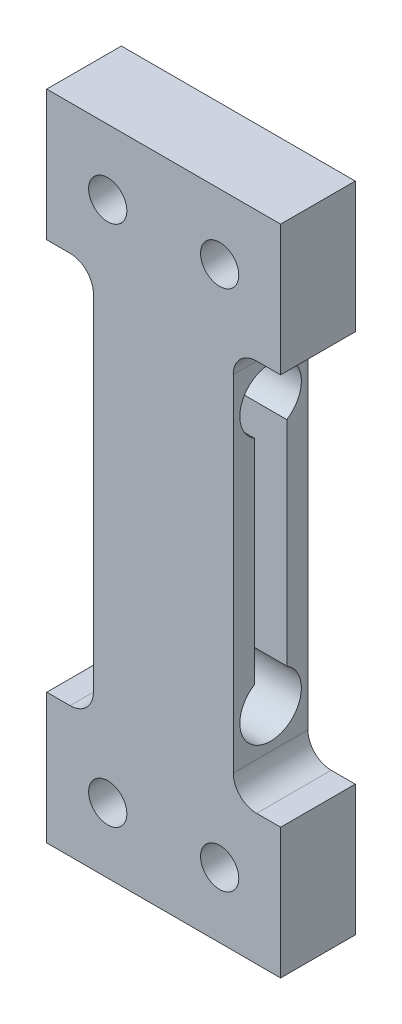
ISO-10303-21;
HEADER;
FILE_DESCRIPTION(('STEP AP214'),'2;1');
FILE_NAME('part.step','',(''),(''),'','','');
FILE_SCHEMA(('AUTOMOTIVE_DESIGN { 1 0 10303 214 1 1 1 1 }'));
ENDSEC;
DATA;
#1=APPLICATION_CONTEXT('core data for automotive mechanical design processes');
#2=APPLICATION_PROTOCOL_DEFINITION('international standard','automotive_design',2000,#1);
#3=PRODUCT_CONTEXT('',#1,'mechanical');
#4=PRODUCT('Part','Part','',(#3));
#5=PRODUCT_RELATED_PRODUCT_CATEGORY('part','',(#4));
#6=PRODUCT_DEFINITION_FORMATION('','',#4);
#7=PRODUCT_DEFINITION_CONTEXT('part definition',#1,'design');
#8=PRODUCT_DEFINITION('design','',#6,#7);
#9=PRODUCT_DEFINITION_SHAPE('','',#8);
#10=(LENGTH_UNIT() NAMED_UNIT(*) SI_UNIT(.MILLI.,.METRE.));
#11=(NAMED_UNIT(*) PLANE_ANGLE_UNIT() SI_UNIT($,.RADIAN.));
#12=(NAMED_UNIT(*) SI_UNIT($,.STERADIAN.) SOLID_ANGLE_UNIT());
#13=UNCERTAINTY_MEASURE_WITH_UNIT(LENGTH_MEASURE(1.E-05),#10,'distance_accuracy_value','');
#14=(GEOMETRIC_REPRESENTATION_CONTEXT(3) GLOBAL_UNCERTAINTY_ASSIGNED_CONTEXT((#13)) GLOBAL_UNIT_ASSIGNED_CONTEXT((#10,
#11,#12)) REPRESENTATION_CONTEXT('',''));
#15=CARTESIAN_POINT('',(0.,0.,0.));
#16=DIRECTION('',(0.,0.,1.));
#17=DIRECTION('',(1.,0.,0.));
#18=AXIS2_PLACEMENT_3D('',#15,#16,#17);
#19=CARTESIAN_POINT('',(2.53843426704407,0.,0.));
#20=DIRECTION('',(1.,0.,0.));
#21=DIRECTION('',(0.,0.,-1.));
#22=AXIS2_PLACEMENT_3D('',#19,#20,#21);
#23=PLANE('',#22);
#24=DIRECTION('',(0.,0.,-1.));
#25=VECTOR('',#24,1.);
#26=CARTESIAN_POINT('',(2.53843426704407,28.,4.));
#27=LINE('',#26,#25);
#28=CARTESIAN_POINT('',(2.53843426704407,28.,4.));
#29=VERTEX_POINT('',#28);
#30=CARTESIAN_POINT('',(2.53843426704407,28.,0.));
#31=VERTEX_POINT('',#30);
#32=EDGE_CURVE('E220',#29,#31,#27,.T.);
#33=ORIENTED_EDGE('',*,*,#32,.T.);
#34=DIRECTION('',(0.,1.,0.));
#35=VECTOR('',#34,1.);
#36=CARTESIAN_POINT('',(2.53843426704407,0.,0.));
#37=LINE('',#36,#35);
#38=CARTESIAN_POINT('',(2.53843426704407,35.,0.));
#39=VERTEX_POINT('',#38);
#40=EDGE_CURVE('E257',#31,#39,#37,.T.);
#41=ORIENTED_EDGE('',*,*,#40,.T.);
#42=DIRECTION('',(0.,0.,1.));
#43=VECTOR('',#42,1.);
#44=CARTESIAN_POINT('',(2.53843426704407,35.,0.));
#45=LINE('',#44,#43);
#46=CARTESIAN_POINT('',(2.53843426704407,35.,4.));
#47=VERTEX_POINT('',#46);
#48=EDGE_CURVE('E274',#39,#47,#45,.T.);
#49=ORIENTED_EDGE('',*,*,#48,.T.);
#50=DIRECTION('',(0.,1.,0.));
#51=VECTOR('',#50,1.);
#52=CARTESIAN_POINT('',(2.53843426704407,0.,4.));
#53=LINE('',#52,#51);
#54=EDGE_CURVE('E271',#29,#47,#53,.T.);
#55=ORIENTED_EDGE('',*,*,#54,.F.);
#56=EDGE_LOOP('',(#33,#41,#49,#55));
#57=FACE_BOUND('',#56,.T.);
#58=ADVANCED_FACE('F34',(#57),#23,.T.);
#59=CARTESIAN_POINT('',(-10.,35.,0.));
#60=DIRECTION('',(-1.,0.,0.));
#61=DIRECTION('',(0.,0.,1.));
#62=AXIS2_PLACEMENT_3D('',#59,#60,#61);
#63=PLANE('',#62);
#64=DIRECTION('',(0.,0.,-1.));
#65=VECTOR('',#64,1.);
#66=CARTESIAN_POINT('',(-10.,7.,4.));
#67=LINE('',#66,#65);
#68=CARTESIAN_POINT('',(-10.,7.,4.));
#69=VERTEX_POINT('',#68);
#70=CARTESIAN_POINT('',(-10.,7.,0.));
#71=VERTEX_POINT('',#70);
#72=EDGE_CURVE('E241',#69,#71,#67,.T.);
#73=ORIENTED_EDGE('',*,*,#72,.T.);
#74=DIRECTION('',(0.,-1.,0.));
#75=VECTOR('',#74,1.);
#76=CARTESIAN_POINT('',(-10.,35.,0.));
#77=LINE('',#76,#75);
#78=CARTESIAN_POINT('',(-10.,0.,0.));
#79=VERTEX_POINT('',#78);
#80=EDGE_CURVE('E249',#71,#79,#77,.T.);
#81=ORIENTED_EDGE('',*,*,#80,.T.);
#82=DIRECTION('',(0.,0.,1.));
#83=VECTOR('',#82,1.);
#84=CARTESIAN_POINT('',(-10.,0.,0.));
#85=LINE('',#84,#83);
#86=CARTESIAN_POINT('',(-10.,0.,4.));
#87=VERTEX_POINT('',#86);
#88=EDGE_CURVE('E280',#79,#87,#85,.T.);
#89=ORIENTED_EDGE('',*,*,#88,.T.);
#90=DIRECTION('',(0.,-1.,0.));
#91=VECTOR('',#90,1.);
#92=CARTESIAN_POINT('',(-10.,35.,4.));
#93=LINE('',#92,#91);
#94=EDGE_CURVE('E264',#69,#87,#93,.T.);
#95=ORIENTED_EDGE('',*,*,#94,.F.);
#96=EDGE_LOOP('',(#73,#81,#89,#95));
#97=FACE_BOUND('',#96,.T.);
#98=ADVANCED_FACE('F354',(#97),#63,.T.);
#99=CARTESIAN_POINT('',(2.53843426704407,35.,0.));
#100=DIRECTION('',(0.,1.,0.));
#101=DIRECTION('',(0.,0.,1.));
#102=AXIS2_PLACEMENT_3D('',#99,#100,#101);
#103=PLANE('',#102);
#104=DIRECTION('',(-1.,0.,0.));
#105=VECTOR('',#104,1.);
#106=CARTESIAN_POINT('',(2.53843426704407,35.,4.));
#107=LINE('',#106,#105);
#108=CARTESIAN_POINT('',(-10.,35.,4.));
#109=VERTEX_POINT('',#108);
#110=EDGE_CURVE('E244',#47,#109,#107,.T.);
#111=ORIENTED_EDGE('',*,*,#110,.F.);
#112=ORIENTED_EDGE('',*,*,#48,.F.);
#113=DIRECTION('',(-1.,0.,0.));
#114=VECTOR('',#113,1.);
#115=CARTESIAN_POINT('',(2.53843426704407,35.,0.));
#116=LINE('',#115,#114);
#117=CARTESIAN_POINT('',(-10.,35.,0.));
#118=VERTEX_POINT('',#117);
#119=EDGE_CURVE('E246',#39,#118,#116,.T.);
#120=ORIENTED_EDGE('',*,*,#119,.T.);
#121=DIRECTION('',(0.,0.,1.));
#122=VECTOR('',#121,1.);
#123=CARTESIAN_POINT('',(-10.,35.,0.));
#124=LINE('',#123,#122);
#125=EDGE_CURVE('E261',#118,#109,#124,.T.);
#126=ORIENTED_EDGE('',*,*,#125,.T.);
#127=EDGE_LOOP('',(#111,#112,#120,#126));
#128=FACE_BOUND('',#127,.T.);
#129=ADVANCED_FACE('F382',(#128),#103,.T.);
#130=DIRECTION('',(0.,0.,-1.));
#131=VECTOR('',#130,1.);
#132=CARTESIAN_POINT('',(2.53843426704407,7.,4.));
#133=LINE('',#132,#131);
#134=CARTESIAN_POINT('',(2.53843426704407,7.,4.));
#135=VERTEX_POINT('',#134);
#136=CARTESIAN_POINT('',(2.53843426704407,7.,0.));
#137=VERTEX_POINT('',#136);
#138=EDGE_CURVE('E214',#135,#137,#133,.T.);
#139=ORIENTED_EDGE('',*,*,#138,.F.);
#140=CARTESIAN_POINT('',(2.53843426704407,0.,4.));
#141=VERTEX_POINT('',#140);
#142=EDGE_CURVE('E250',#141,#135,#53,.T.);
#143=ORIENTED_EDGE('',*,*,#142,.F.);
#144=DIRECTION('',(0.,0.,1.));
#145=VECTOR('',#144,1.);
#146=CARTESIAN_POINT('',(2.53843426704407,0.,0.));
#147=LINE('',#146,#145);
#148=CARTESIAN_POINT('',(2.53843426704407,0.,0.));
#149=VERTEX_POINT('',#148);
#150=EDGE_CURVE('E278',#149,#141,#147,.T.);
#151=ORIENTED_EDGE('',*,*,#150,.F.);
#152=EDGE_CURVE('E258',#149,#137,#37,.T.);
#153=ORIENTED_EDGE('',*,*,#152,.T.);
#154=EDGE_LOOP('',(#139,#143,#151,#153));
#155=FACE_BOUND('',#154,.T.);
#156=ADVANCED_FACE('F343',(#155),#23,.T.);
#157=CARTESIAN_POINT('',(-10.,0.,0.));
#158=DIRECTION('',(0.,-1.,0.));
#159=DIRECTION('',(0.,0.,-1.));
#160=AXIS2_PLACEMENT_3D('',#157,#158,#159);
#161=PLANE('',#160);
#162=DIRECTION('',(1.,0.,0.));
#163=VECTOR('',#162,1.);
#164=CARTESIAN_POINT('',(-10.,0.,4.));
#165=LINE('',#164,#163);
#166=EDGE_CURVE('E268',#87,#141,#165,.T.);
#167=ORIENTED_EDGE('',*,*,#166,.F.);
#168=ORIENTED_EDGE('',*,*,#88,.F.);
#169=DIRECTION('',(1.,0.,0.));
#170=VECTOR('',#169,1.);
#171=CARTESIAN_POINT('',(-10.,0.,0.));
#172=LINE('',#171,#170);
#173=EDGE_CURVE('E254',#79,#149,#172,.T.);
#174=ORIENTED_EDGE('',*,*,#173,.T.);
#175=ORIENTED_EDGE('',*,*,#150,.T.);
#176=EDGE_LOOP('',(#167,#168,#174,#175));
#177=FACE_BOUND('',#176,.T.);
#178=ADVANCED_FACE('F351',(#177),#161,.T.);
#179=DIRECTION('',(0.,0.,-1.));
#180=VECTOR('',#179,1.);
#181=CARTESIAN_POINT('',(-10.,28.,4.));
#182=LINE('',#181,#180);
#183=CARTESIAN_POINT('',(-10.,28.,4.));
#184=VERTEX_POINT('',#183);
#185=CARTESIAN_POINT('',(-10.,28.,0.));
#186=VERTEX_POINT('',#185);
#187=EDGE_CURVE('E234',#184,#186,#182,.T.);
#188=ORIENTED_EDGE('',*,*,#187,.F.);
#189=EDGE_CURVE('E265',#109,#184,#93,.T.);
#190=ORIENTED_EDGE('',*,*,#189,.F.);
#191=ORIENTED_EDGE('',*,*,#125,.F.);
#192=EDGE_CURVE('E251',#118,#186,#77,.T.);
#193=ORIENTED_EDGE('',*,*,#192,.T.);
#194=EDGE_LOOP('',(#188,#190,#191,#193));
#195=FACE_BOUND('',#194,.T.);
#196=ADVANCED_FACE('F378',(#195),#63,.T.);
#197=CARTESIAN_POINT('',(-10.,35.,0.));
#198=DIRECTION('',(0.,0.,1.));
#199=DIRECTION('',(1.,0.,0.));
#200=AXIS2_PLACEMENT_3D('',#197,#198,#199);
#201=PLANE('',#200);
#202=CARTESIAN_POINT('',(-0.730782866478019,3.49999999999998,0.));
#203=DIRECTION('',(0.,0.,1.));
#204=DIRECTION('',(1.,0.,0.));
#205=AXIS2_PLACEMENT_3D('',#202,#203,#204);
#206=CIRCLE('',#205,1.025);
#207=CARTESIAN_POINT('',(0.29421713352198,3.49999999999998,0.));
#208=VERTEX_POINT('',#207);
#209=EDGE_CURVE('E628',#208,#208,#206,.T.);
#210=ORIENTED_EDGE('',*,*,#209,.T.);
#211=EDGE_LOOP('',(#210));
#212=FACE_BOUND('',#211,.T.);
#213=CARTESIAN_POINT('',(-6.73078286647802,3.5,0.));
#214=DIRECTION('',(0.,0.,1.));
#215=DIRECTION('',(1.,0.,0.));
#216=AXIS2_PLACEMENT_3D('',#213,#214,#215);
#217=CIRCLE('',#216,1.025);
#218=CARTESIAN_POINT('',(-5.70578286647802,3.5,0.));
#219=VERTEX_POINT('',#218);
#220=EDGE_CURVE('E622',#219,#219,#217,.T.);
#221=ORIENTED_EDGE('',*,*,#220,.T.);
#222=EDGE_LOOP('',(#221));
#223=FACE_BOUND('',#222,.T.);
#224=CARTESIAN_POINT('',(-0.730782866478016,31.5,0.));
#225=DIRECTION('',(0.,0.,1.));
#226=DIRECTION('',(1.,0.,0.));
#227=AXIS2_PLACEMENT_3D('',#224,#225,#226);
#228=CIRCLE('',#227,1.025);
#229=CARTESIAN_POINT('',(0.294217133521983,31.5,0.));
#230=VERTEX_POINT('',#229);
#231=EDGE_CURVE('E616',#230,#230,#228,.T.);
#232=ORIENTED_EDGE('',*,*,#231,.T.);
#233=EDGE_LOOP('',(#232));
#234=FACE_BOUND('',#233,.T.);
#235=CARTESIAN_POINT('',(-6.73078286647802,31.5,0.));
#236=DIRECTION('',(0.,0.,1.));
#237=DIRECTION('',(1.,0.,0.));
#238=AXIS2_PLACEMENT_3D('',#235,#236,#237);
#239=CIRCLE('',#238,1.025);
#240=CARTESIAN_POINT('',(-5.70578286647802,31.5,0.));
#241=VERTEX_POINT('',#240);
#242=EDGE_CURVE('E192',#241,#241,#239,.T.);
#243=ORIENTED_EDGE('',*,*,#242,.T.);
#244=EDGE_LOOP('',(#243));
#245=FACE_BOUND('',#244,.T.);
#246=ORIENTED_EDGE('',*,*,#40,.F.);
#247=DIRECTION('',(1.,0.,0.));
#248=VECTOR('',#247,1.);
#249=CARTESIAN_POINT('',(0.,28.,0.));
#250=LINE('',#249,#248);
#251=CARTESIAN_POINT('',(1.25,28.,0.));
#252=VERTEX_POINT('',#251);
#253=EDGE_CURVE('E209',#252,#31,#250,.T.);
#254=ORIENTED_EDGE('',*,*,#253,.F.);
#255=CARTESIAN_POINT('',(1.25,26.75,0.));
#256=DIRECTION('',(0.,0.,1.));
#257=DIRECTION('',(1.,0.,0.));
#258=AXIS2_PLACEMENT_3D('',#255,#256,#257);
#259=CIRCLE('',#258,1.25);
#260=CARTESIAN_POINT('',(0.,26.75,0.));
#261=VERTEX_POINT('',#260);
#262=EDGE_CURVE('E315',#252,#261,#259,.T.);
#263=ORIENTED_EDGE('',*,*,#262,.T.);
#264=DIRECTION('',(0.,1.,0.));
#265=VECTOR('',#264,1.);
#266=CARTESIAN_POINT('',(0.,6.99999999999999,0.));
#267=LINE('',#266,#265);
#268=CARTESIAN_POINT('',(0.,8.24999999999999,0.));
#269=VERTEX_POINT('',#268);
#270=EDGE_CURVE('E216',#269,#261,#267,.T.);
#271=ORIENTED_EDGE('',*,*,#270,.F.);
#272=CARTESIAN_POINT('',(1.25,8.24999999999999,0.));
#273=DIRECTION('',(0.,0.,1.));
#274=DIRECTION('',(1.,0.,0.));
#275=AXIS2_PLACEMENT_3D('',#272,#273,#274);
#276=CIRCLE('',#275,1.25);
#277=CARTESIAN_POINT('',(1.25,7.,0.));
#278=VERTEX_POINT('',#277);
#279=EDGE_CURVE('E42',#269,#278,#276,.T.);
#280=ORIENTED_EDGE('',*,*,#279,.T.);
#281=DIRECTION('',(-1.,0.,0.));
#282=VECTOR('',#281,1.);
#283=CARTESIAN_POINT('',(2.53843426704407,7.,0.));
#284=LINE('',#283,#282);
#285=EDGE_CURVE('E180',#137,#278,#284,.T.);
#286=ORIENTED_EDGE('',*,*,#285,.F.);
#287=ORIENTED_EDGE('',*,*,#152,.F.);
#288=ORIENTED_EDGE('',*,*,#173,.F.);
#289=ORIENTED_EDGE('',*,*,#80,.F.);
#290=DIRECTION('',(-1.,0.,0.));
#291=VECTOR('',#290,1.);
#292=CARTESIAN_POINT('',(-7.5,6.99999999999999,0.));
#293=LINE('',#292,#291);
#294=CARTESIAN_POINT('',(-8.75000000000001,6.99999999999999,0.));
#295=VERTEX_POINT('',#294);
#296=EDGE_CURVE('E229',#295,#71,#293,.T.);
#297=ORIENTED_EDGE('',*,*,#296,.F.);
#298=CARTESIAN_POINT('',(-8.75,8.24999999999999,0.));
#299=DIRECTION('',(0.,0.,1.));
#300=DIRECTION('',(1.,0.,0.));
#301=AXIS2_PLACEMENT_3D('',#298,#299,#300);
#302=CIRCLE('',#301,1.25);
#303=CARTESIAN_POINT('',(-7.5,8.24999999999999,0.));
#304=VERTEX_POINT('',#303);
#305=EDGE_CURVE('E311',#295,#304,#302,.T.);
#306=ORIENTED_EDGE('',*,*,#305,.T.);
#307=DIRECTION('',(0.,-1.,0.));
#308=VECTOR('',#307,1.);
#309=CARTESIAN_POINT('',(-7.5,28.,0.));
#310=LINE('',#309,#308);
#311=CARTESIAN_POINT('',(-7.5,26.75,0.));
#312=VERTEX_POINT('',#311);
#313=EDGE_CURVE('E237',#312,#304,#310,.T.);
#314=ORIENTED_EDGE('',*,*,#313,.F.);
#315=CARTESIAN_POINT('',(-8.75,26.75,0.));
#316=DIRECTION('',(0.,0.,1.));
#317=DIRECTION('',(1.,0.,0.));
#318=AXIS2_PLACEMENT_3D('',#315,#316,#317);
#319=CIRCLE('',#318,1.25);
#320=CARTESIAN_POINT('',(-8.74999999999999,28.,0.));
#321=VERTEX_POINT('',#320);
#322=EDGE_CURVE('E307',#312,#321,#319,.T.);
#323=ORIENTED_EDGE('',*,*,#322,.T.);
#324=DIRECTION('',(1.,0.,0.));
#325=VECTOR('',#324,1.);
#326=CARTESIAN_POINT('',(-10.,28.,0.));
#327=LINE('',#326,#325);
#328=EDGE_CURVE('E223',#186,#321,#327,.T.);
#329=ORIENTED_EDGE('',*,*,#328,.F.);
#330=ORIENTED_EDGE('',*,*,#192,.F.);
#331=ORIENTED_EDGE('',*,*,#119,.F.);
#332=EDGE_LOOP('',(#246,#254,#263,#271,#280,#286,#287,#288,#289,#297,#306,#314,#323,#329,#330,#331));
#333=FACE_BOUND('',#332,.T.);
#334=ADVANCED_FACE('F333',(#212,#223,#234,#245,#333),#201,.F.);
#335=CARTESIAN_POINT('',(-10.,35.,4.));
#336=DIRECTION('',(0.,0.,1.));
#337=DIRECTION('',(1.,0.,0.));
#338=AXIS2_PLACEMENT_3D('',#335,#336,#337);
#339=PLANE('',#338);
#340=CARTESIAN_POINT('',(-0.730782866478019,3.49999999999998,4.));
#341=DIRECTION('',(0.,0.,1.));
#342=DIRECTION('',(1.,0.,0.));
#343=AXIS2_PLACEMENT_3D('',#340,#341,#342);
#344=CIRCLE('',#343,1.02499999999999);
#345=CARTESIAN_POINT('',(0.294217133521969,3.49999999999998,4.));
#346=VERTEX_POINT('',#345);
#347=EDGE_CURVE('E631',#346,#346,#344,.T.);
#348=ORIENTED_EDGE('',*,*,#347,.F.);
#349=EDGE_LOOP('',(#348));
#350=FACE_BOUND('',#349,.T.);
#351=CARTESIAN_POINT('',(-6.73078286647802,3.5,4.));
#352=DIRECTION('',(0.,0.,1.));
#353=DIRECTION('',(1.,0.,0.));
#354=AXIS2_PLACEMENT_3D('',#351,#352,#353);
#355=CIRCLE('',#354,1.02499999999999);
#356=CARTESIAN_POINT('',(-5.70578286647803,3.5,4.));
#357=VERTEX_POINT('',#356);
#358=EDGE_CURVE('E625',#357,#357,#355,.T.);
#359=ORIENTED_EDGE('',*,*,#358,.F.);
#360=EDGE_LOOP('',(#359));
#361=FACE_BOUND('',#360,.T.);
#362=CARTESIAN_POINT('',(-0.730782866478016,31.5,4.));
#363=DIRECTION('',(0.,0.,1.));
#364=DIRECTION('',(1.,0.,0.));
#365=AXIS2_PLACEMENT_3D('',#362,#363,#364);
#366=CIRCLE('',#365,1.02499999999999);
#367=CARTESIAN_POINT('',(0.294217133521972,31.5,4.));
#368=VERTEX_POINT('',#367);
#369=EDGE_CURVE('E619',#368,#368,#366,.T.);
#370=ORIENTED_EDGE('',*,*,#369,.F.);
#371=EDGE_LOOP('',(#370));
#372=FACE_BOUND('',#371,.T.);
#373=CARTESIAN_POINT('',(-6.73078286647802,31.5,4.));
#374=DIRECTION('',(0.,0.,1.));
#375=DIRECTION('',(1.,0.,0.));
#376=AXIS2_PLACEMENT_3D('',#373,#374,#375);
#377=CIRCLE('',#376,1.02499999999999);
#378=CARTESIAN_POINT('',(-5.70578286647803,31.5,4.));
#379=VERTEX_POINT('',#378);
#380=EDGE_CURVE('E613',#379,#379,#377,.T.);
#381=ORIENTED_EDGE('',*,*,#380,.F.);
#382=EDGE_LOOP('',(#381));
#383=FACE_BOUND('',#382,.T.);
#384=DIRECTION('',(0.,1.,0.));
#385=VECTOR('',#384,1.);
#386=CARTESIAN_POINT('',(0.,6.99999999999999,4.));
#387=LINE('',#386,#385);
#388=CARTESIAN_POINT('',(0.,8.24999999999999,4.));
#389=VERTEX_POINT('',#388);
#390=CARTESIAN_POINT('',(0.,26.75,4.));
#391=VERTEX_POINT('',#390);
#392=EDGE_CURVE('E208',#389,#391,#387,.T.);
#393=ORIENTED_EDGE('',*,*,#392,.T.);
#394=CARTESIAN_POINT('',(1.25,26.75,4.));
#395=DIRECTION('',(0.,0.,1.));
#396=DIRECTION('',(1.,0.,0.));
#397=AXIS2_PLACEMENT_3D('',#394,#395,#396);
#398=CIRCLE('',#397,1.25);
#399=CARTESIAN_POINT('',(1.25,28.,4.));
#400=VERTEX_POINT('',#399);
#401=EDGE_CURVE('E317',#391,#400,#398,.F.);
#402=ORIENTED_EDGE('',*,*,#401,.T.);
#403=DIRECTION('',(1.,0.,0.));
#404=VECTOR('',#403,1.);
#405=CARTESIAN_POINT('',(0.,28.,4.));
#406=LINE('',#405,#404);
#407=EDGE_CURVE('E212',#400,#29,#406,.T.);
#408=ORIENTED_EDGE('',*,*,#407,.T.);
#409=ORIENTED_EDGE('',*,*,#54,.T.);
#410=ORIENTED_EDGE('',*,*,#110,.T.);
#411=ORIENTED_EDGE('',*,*,#189,.T.);
#412=DIRECTION('',(1.,0.,0.));
#413=VECTOR('',#412,1.);
#414=CARTESIAN_POINT('',(-10.,28.,4.));
#415=LINE('',#414,#413);
#416=CARTESIAN_POINT('',(-8.74999999999999,28.,4.));
#417=VERTEX_POINT('',#416);
#418=EDGE_CURVE('E225',#184,#417,#415,.T.);
#419=ORIENTED_EDGE('',*,*,#418,.T.);
#420=CARTESIAN_POINT('',(-8.75,26.75,4.));
#421=DIRECTION('',(0.,0.,1.));
#422=DIRECTION('',(1.,0.,0.));
#423=AXIS2_PLACEMENT_3D('',#420,#421,#422);
#424=CIRCLE('',#423,1.25);
#425=CARTESIAN_POINT('',(-7.5,26.75,4.));
#426=VERTEX_POINT('',#425);
#427=EDGE_CURVE('E309',#417,#426,#424,.F.);
#428=ORIENTED_EDGE('',*,*,#427,.T.);
#429=DIRECTION('',(0.,-1.,0.));
#430=VECTOR('',#429,1.);
#431=CARTESIAN_POINT('',(-7.5,28.,4.));
#432=LINE('',#431,#430);
#433=CARTESIAN_POINT('',(-7.5,8.24999999999999,4.));
#434=VERTEX_POINT('',#433);
#435=EDGE_CURVE('E228',#426,#434,#432,.T.);
#436=ORIENTED_EDGE('',*,*,#435,.T.);
#437=CARTESIAN_POINT('',(-8.75,8.24999999999999,4.));
#438=DIRECTION('',(0.,0.,1.));
#439=DIRECTION('',(1.,0.,0.));
#440=AXIS2_PLACEMENT_3D('',#437,#438,#439);
#441=CIRCLE('',#440,1.25);
#442=CARTESIAN_POINT('',(-8.75000000000001,6.99999999999999,4.));
#443=VERTEX_POINT('',#442);
#444=EDGE_CURVE('E313',#434,#443,#441,.F.);
#445=ORIENTED_EDGE('',*,*,#444,.T.);
#446=DIRECTION('',(-1.,0.,0.));
#447=VECTOR('',#446,1.);
#448=CARTESIAN_POINT('',(-7.5,6.99999999999999,4.));
#449=LINE('',#448,#447);
#450=EDGE_CURVE('E232',#443,#69,#449,.T.);
#451=ORIENTED_EDGE('',*,*,#450,.T.);
#452=ORIENTED_EDGE('',*,*,#94,.T.);
#453=ORIENTED_EDGE('',*,*,#166,.T.);
#454=ORIENTED_EDGE('',*,*,#142,.T.);
#455=DIRECTION('',(-1.,0.,0.));
#456=VECTOR('',#455,1.);
#457=CARTESIAN_POINT('',(2.53843426704407,7.,4.));
#458=LINE('',#457,#456);
#459=CARTESIAN_POINT('',(1.25,7.,4.));
#460=VERTEX_POINT('',#459);
#461=EDGE_CURVE('E206',#135,#460,#458,.T.);
#462=ORIENTED_EDGE('',*,*,#461,.T.);
#463=CARTESIAN_POINT('',(1.25,8.24999999999999,4.));
#464=DIRECTION('',(0.,0.,1.));
#465=DIRECTION('',(1.,0.,0.));
#466=AXIS2_PLACEMENT_3D('',#463,#464,#465);
#467=CIRCLE('',#466,1.25);
#468=EDGE_CURVE('E11',#460,#389,#467,.F.);
#469=ORIENTED_EDGE('',*,*,#468,.T.);
#470=EDGE_LOOP('',(#393,#402,#408,#409,#410,#411,#419,#428,#436,#445,#451,#452,#453,#454,#462,#469));
#471=FACE_BOUND('',#470,.T.);
#472=ADVANCED_FACE('F321',(#350,#361,#372,#383,#471),#339,.T.);
#473=CARTESIAN_POINT('',(-7.5,6.99999999999999,4.));
#474=DIRECTION('',(0.,-1.,0.));
#475=DIRECTION('',(1.,0.,0.));
#476=AXIS2_PLACEMENT_3D('',#473,#474,#475);
#477=PLANE('',#476);
#478=ORIENTED_EDGE('',*,*,#450,.F.);
#479=DIRECTION('',(0.,0.,-1.));
#480=VECTOR('',#479,1.);
#481=CARTESIAN_POINT('',(-8.75000000000001,6.99999999999999,0.));
#482=LINE('',#481,#480);
#483=EDGE_CURVE('E295',#443,#295,#482,.T.);
#484=ORIENTED_EDGE('',*,*,#483,.T.);
#485=ORIENTED_EDGE('',*,*,#296,.T.);
#486=ORIENTED_EDGE('',*,*,#72,.F.);
#487=EDGE_LOOP('',(#478,#484,#485,#486));
#488=FACE_BOUND('',#487,.T.);
#489=ADVANCED_FACE('F358',(#488),#477,.F.);
#490=CARTESIAN_POINT('',(-7.5,28.,4.));
#491=DIRECTION('',(1.,0.,0.));
#492=DIRECTION('',(0.,1.,0.));
#493=AXIS2_PLACEMENT_3D('',#490,#491,#492);
#494=PLANE('',#493);
#495=DIRECTION('',(0.,1.,0.));
#496=VECTOR('',#495,1.);
#497=CARTESIAN_POINT('',(-7.5,11.7856301404825,2.85593376306963));
#498=LINE('',#497,#496);
#499=CARTESIAN_POINT('',(-7.5,11.7856301404825,2.85593376306963));
#500=VERTEX_POINT('',#499);
#501=CARTESIAN_POINT('',(-7.5,23.2143698595176,2.85593376306961));
#502=VERTEX_POINT('',#501);
#503=EDGE_CURVE('E191',#500,#502,#498,.T.);
#504=ORIENTED_EDGE('',*,*,#503,.F.);
#505=CARTESIAN_POINT('',(-7.5,10.375,2.));
#506=DIRECTION('',(-1.,0.,0.));
#507=DIRECTION('',(0.,0.,1.));
#508=AXIS2_PLACEMENT_3D('',#505,#506,#507);
#509=CIRCLE('',#508,1.65000000000002);
#510=CARTESIAN_POINT('',(-7.5,11.7781326807042,1.13183026985506));
#511=VERTEX_POINT('',#510);
#512=EDGE_CURVE('E172',#511,#500,#509,.T.);
#513=ORIENTED_EDGE('',*,*,#512,.F.);
#514=DIRECTION('',(0.,-1.,0.));
#515=VECTOR('',#514,1.);
#516=CARTESIAN_POINT('',(-7.5,23.2218673192958,1.13183026985509));
#517=LINE('',#516,#515);
#518=CARTESIAN_POINT('',(-7.5,23.2218673192958,1.13183026985507));
#519=VERTEX_POINT('',#518);
#520=EDGE_CURVE('E189',#519,#511,#517,.T.);
#521=ORIENTED_EDGE('',*,*,#520,.F.);
#522=CARTESIAN_POINT('',(-7.5,24.625,2.));
#523=DIRECTION('',(-1.,0.,0.));
#524=DIRECTION('',(0.,0.,1.));
#525=AXIS2_PLACEMENT_3D('',#522,#523,#524);
#526=CIRCLE('',#525,1.65000000000001);
#527=EDGE_CURVE('E606',#502,#519,#526,.T.);
#528=ORIENTED_EDGE('',*,*,#527,.F.);
#529=EDGE_LOOP('',(#504,#513,#521,#528));
#530=FACE_BOUND('',#529,.T.);
#531=ORIENTED_EDGE('',*,*,#435,.F.);
#532=DIRECTION('',(0.,0.,-1.));
#533=VECTOR('',#532,1.);
#534=CARTESIAN_POINT('',(-7.5,26.75,0.));
#535=LINE('',#534,#533);
#536=EDGE_CURVE('E290',#426,#312,#535,.T.);
#537=ORIENTED_EDGE('',*,*,#536,.T.);
#538=ORIENTED_EDGE('',*,*,#313,.T.);
#539=DIRECTION('',(0.,0.,-1.));
#540=VECTOR('',#539,1.);
#541=CARTESIAN_POINT('',(-7.5,8.24999999999999,4.));
#542=LINE('',#541,#540);
#543=EDGE_CURVE('E288',#304,#434,#542,.F.);
#544=ORIENTED_EDGE('',*,*,#543,.T.);
#545=EDGE_LOOP('',(#531,#537,#538,#544));
#546=FACE_BOUND('',#545,.T.);
#547=ADVANCED_FACE('F186',(#530,#546),#494,.F.);
#548=CARTESIAN_POINT('',(-10.,28.,4.));
#549=DIRECTION('',(0.,1.,0.));
#550=DIRECTION('',(-1.,0.,0.));
#551=AXIS2_PLACEMENT_3D('',#548,#549,#550);
#552=PLANE('',#551);
#553=ORIENTED_EDGE('',*,*,#328,.T.);
#554=DIRECTION('',(0.,0.,-1.));
#555=VECTOR('',#554,1.);
#556=CARTESIAN_POINT('',(-8.74999999999999,28.,4.));
#557=LINE('',#556,#555);
#558=EDGE_CURVE('E293',#321,#417,#557,.F.);
#559=ORIENTED_EDGE('',*,*,#558,.T.);
#560=ORIENTED_EDGE('',*,*,#418,.F.);
#561=ORIENTED_EDGE('',*,*,#187,.T.);
#562=EDGE_LOOP('',(#553,#559,#560,#561));
#563=FACE_BOUND('',#562,.T.);
#564=ADVANCED_FACE('F374',(#563),#552,.F.);
#565=CARTESIAN_POINT('',(0.,28.,4.));
#566=DIRECTION('',(0.,1.,0.));
#567=DIRECTION('',(-1.,0.,0.));
#568=AXIS2_PLACEMENT_3D('',#565,#566,#567);
#569=PLANE('',#568);
#570=ORIENTED_EDGE('',*,*,#407,.F.);
#571=DIRECTION('',(0.,0.,-1.));
#572=VECTOR('',#571,1.);
#573=CARTESIAN_POINT('',(1.25,28.,0.));
#574=LINE('',#573,#572);
#575=EDGE_CURVE('E298',#400,#252,#574,.T.);
#576=ORIENTED_EDGE('',*,*,#575,.T.);
#577=ORIENTED_EDGE('',*,*,#253,.T.);
#578=ORIENTED_EDGE('',*,*,#32,.F.);
#579=EDGE_LOOP('',(#570,#576,#577,#578));
#580=FACE_BOUND('',#579,.T.);
#581=ADVANCED_FACE('F328',(#580),#569,.F.);
#582=CARTESIAN_POINT('',(0.,6.99999999999999,4.));
#583=DIRECTION('',(-1.,0.,0.));
#584=DIRECTION('',(0.,-1.,0.));
#585=AXIS2_PLACEMENT_3D('',#582,#583,#584);
#586=PLANE('',#585);
#587=DIRECTION('',(0.,-1.,0.));
#588=VECTOR('',#587,1.);
#589=CARTESIAN_POINT('',(0.,7.,1.13183026985505));
#590=LINE('',#589,#588);
#591=CARTESIAN_POINT('',(0.,23.2218673192958,1.13183026985506));
#592=VERTEX_POINT('',#591);
#593=CARTESIAN_POINT('',(0.,11.7781326807042,1.13183026985506));
#594=VERTEX_POINT('',#593);
#595=EDGE_CURVE('E286',#592,#594,#590,.T.);
#596=ORIENTED_EDGE('',*,*,#595,.T.);
#597=CARTESIAN_POINT('',(0.,10.375,2.));
#598=DIRECTION('',(-1.,0.,0.));
#599=DIRECTION('',(0.,0.,1.));
#600=AXIS2_PLACEMENT_3D('',#597,#598,#599);
#601=CIRCLE('',#600,1.64999999999999);
#602=CARTESIAN_POINT('',(0.,11.7856301404824,2.85593376306963));
#603=VERTEX_POINT('',#602);
#604=EDGE_CURVE('E175',#594,#603,#601,.T.);
#605=ORIENTED_EDGE('',*,*,#604,.T.);
#606=DIRECTION('',(0.,1.,0.));
#607=VECTOR('',#606,1.);
#608=CARTESIAN_POINT('',(0.,6.99999999999999,2.85593376306963));
#609=LINE('',#608,#607);
#610=CARTESIAN_POINT('',(0.,23.2143698595176,2.85593376306961));
#611=VERTEX_POINT('',#610);
#612=EDGE_CURVE('E277',#603,#611,#609,.T.);
#613=ORIENTED_EDGE('',*,*,#612,.T.);
#614=CARTESIAN_POINT('',(0.,24.625,2.));
#615=DIRECTION('',(-1.,0.,0.));
#616=DIRECTION('',(0.,0.,1.));
#617=AXIS2_PLACEMENT_3D('',#614,#615,#616);
#618=CIRCLE('',#617,1.65000000000003);
#619=EDGE_CURVE('E200',#611,#592,#618,.T.);
#620=ORIENTED_EDGE('',*,*,#619,.T.);
#621=EDGE_LOOP('',(#596,#605,#613,#620));
#622=FACE_BOUND('',#621,.T.);
#623=ORIENTED_EDGE('',*,*,#270,.T.);
#624=DIRECTION('',(0.,0.,-1.));
#625=VECTOR('',#624,1.);
#626=CARTESIAN_POINT('',(0.,26.75,4.));
#627=LINE('',#626,#625);
#628=EDGE_CURVE('E304',#261,#391,#627,.F.);
#629=ORIENTED_EDGE('',*,*,#628,.T.);
#630=ORIENTED_EDGE('',*,*,#392,.F.);
#631=DIRECTION('',(0.,0.,-1.));
#632=VECTOR('',#631,1.);
#633=CARTESIAN_POINT('',(0.,8.24999999999999,0.));
#634=LINE('',#633,#632);
#635=EDGE_CURVE('E301',#389,#269,#634,.T.);
#636=ORIENTED_EDGE('',*,*,#635,.T.);
#637=EDGE_LOOP('',(#623,#629,#630,#636));
#638=FACE_BOUND('',#637,.T.);
#639=ADVANCED_FACE('F335',(#622,#638),#586,.F.);
#640=CARTESIAN_POINT('',(2.53843426704407,7.,4.));
#641=DIRECTION('',(0.,-1.,0.));
#642=DIRECTION('',(1.,0.,0.));
#643=AXIS2_PLACEMENT_3D('',#640,#641,#642);
#644=PLANE('',#643);
#645=ORIENTED_EDGE('',*,*,#285,.T.);
#646=DIRECTION('',(0.,0.,-1.));
#647=VECTOR('',#646,1.);
#648=CARTESIAN_POINT('',(1.25,7.,4.));
#649=LINE('',#648,#647);
#650=EDGE_CURVE('E49',#278,#460,#649,.F.);
#651=ORIENTED_EDGE('',*,*,#650,.T.);
#652=ORIENTED_EDGE('',*,*,#461,.F.);
#653=ORIENTED_EDGE('',*,*,#138,.T.);
#654=EDGE_LOOP('',(#645,#651,#652,#653));
#655=FACE_BOUND('',#654,.T.);
#656=ADVANCED_FACE('F341',(#655),#644,.F.);
#657=CARTESIAN_POINT('',(2.53843426704407,23.2218673192958,1.13183026985509));
#658=DIRECTION('',(0.,0.,-1.));
#659=DIRECTION('',(0.,1.,0.));
#660=AXIS2_PLACEMENT_3D('',#657,#658,#659);
#661=PLANE('',#660);
#662=DIRECTION('',(-1.,0.,0.));
#663=VECTOR('',#662,1.);
#664=CARTESIAN_POINT('',(2.53843426704407,23.2218673192958,1.13183026985509));
#665=LINE('',#664,#663);
#666=EDGE_CURVE('E181',#592,#519,#665,.T.);
#667=ORIENTED_EDGE('',*,*,#666,.T.);
#668=ORIENTED_EDGE('',*,*,#520,.T.);
#669=DIRECTION('',(-1.,0.,0.));
#670=VECTOR('',#669,1.);
#671=CARTESIAN_POINT('',(2.53843426704407,11.7781326807042,1.13183026985506));
#672=LINE('',#671,#670);
#673=EDGE_CURVE('E169',#594,#511,#672,.T.);
#674=ORIENTED_EDGE('',*,*,#673,.F.);
#675=ORIENTED_EDGE('',*,*,#595,.F.);
#676=EDGE_LOOP('',(#667,#668,#674,#675));
#677=FACE_BOUND('',#676,.T.);
#678=ADVANCED_FACE('F195',(#677),#661,.F.);
#679=CARTESIAN_POINT('',(2.53843426704407,11.7856301404825,2.85593376306963));
#680=DIRECTION('',(0.,0.,1.));
#681=DIRECTION('',(0.,-1.,0.));
#682=AXIS2_PLACEMENT_3D('',#679,#680,#681);
#683=PLANE('',#682);
#684=DIRECTION('',(-1.,0.,0.));
#685=VECTOR('',#684,1.);
#686=CARTESIAN_POINT('',(2.53843426704407,11.7856301404825,2.85593376306963));
#687=LINE('',#686,#685);
#688=EDGE_CURVE('E196',#603,#500,#687,.T.);
#689=ORIENTED_EDGE('',*,*,#688,.T.);
#690=ORIENTED_EDGE('',*,*,#503,.T.);
#691=DIRECTION('',(-1.,0.,0.));
#692=VECTOR('',#691,1.);
#693=CARTESIAN_POINT('',(2.53843426704408,23.2143698595176,2.85593376306961));
#694=LINE('',#693,#692);
#695=EDGE_CURVE('E198',#611,#502,#694,.T.);
#696=ORIENTED_EDGE('',*,*,#695,.F.);
#697=ORIENTED_EDGE('',*,*,#612,.F.);
#698=EDGE_LOOP('',(#689,#690,#696,#697));
#699=FACE_BOUND('',#698,.T.);
#700=ADVANCED_FACE('F555',(#699),#683,.F.);
#701=CARTESIAN_POINT('',(0.,24.625,2.));
#702=DIRECTION('',(-1.,0.,0.));
#703=DIRECTION('',(0.,0.,1.));
#704=AXIS2_PLACEMENT_3D('',#701,#702,#703);
#705=CYLINDRICAL_SURFACE('',#704,1.65000000000002);
#706=ORIENTED_EDGE('',*,*,#619,.F.);
#707=ORIENTED_EDGE('',*,*,#695,.T.);
#708=ORIENTED_EDGE('',*,*,#527,.T.);
#709=ORIENTED_EDGE('',*,*,#666,.F.);
#710=EDGE_LOOP('',(#706,#707,#708,#709));
#711=FACE_BOUND('',#710,.T.);
#712=ADVANCED_FACE('F548',(#711),#705,.F.);
#713=CARTESIAN_POINT('',(0.,10.375,2.));
#714=DIRECTION('',(-1.,0.,0.));
#715=DIRECTION('',(0.,0.,1.));
#716=AXIS2_PLACEMENT_3D('',#713,#714,#715);
#717=CYLINDRICAL_SURFACE('',#716,1.65000000000001);
#718=ORIENTED_EDGE('',*,*,#512,.T.);
#719=ORIENTED_EDGE('',*,*,#688,.F.);
#720=ORIENTED_EDGE('',*,*,#604,.F.);
#721=ORIENTED_EDGE('',*,*,#673,.T.);
#722=EDGE_LOOP('',(#718,#719,#720,#721));
#723=FACE_BOUND('',#722,.T.);
#724=ADVANCED_FACE('F171',(#723),#717,.F.);
#725=CARTESIAN_POINT('',(-6.73078286647802,31.5,4.));
#726=DIRECTION('',(0.,0.,1.));
#727=DIRECTION('',(1.,0.,0.));
#728=AXIS2_PLACEMENT_3D('',#725,#726,#727);
#729=CYLINDRICAL_SURFACE('',#728,1.02499999999999);
#730=ORIENTED_EDGE('',*,*,#242,.F.);
#731=EDGE_LOOP('',(#730));
#732=FACE_BOUND('',#731,.T.);
#733=ORIENTED_EDGE('',*,*,#380,.T.);
#734=EDGE_LOOP('',(#733));
#735=FACE_BOUND('',#734,.T.);
#736=ADVANCED_FACE('F529',(#732,#735),#729,.F.);
#737=CARTESIAN_POINT('',(-0.730782866478016,31.5,4.));
#738=DIRECTION('',(0.,0.,1.));
#739=DIRECTION('',(1.,0.,0.));
#740=AXIS2_PLACEMENT_3D('',#737,#738,#739);
#741=CYLINDRICAL_SURFACE('',#740,1.02499999999999);
#742=ORIENTED_EDGE('',*,*,#231,.F.);
#743=EDGE_LOOP('',(#742));
#744=FACE_BOUND('',#743,.T.);
#745=ORIENTED_EDGE('',*,*,#369,.T.);
#746=EDGE_LOOP('',(#745));
#747=FACE_BOUND('',#746,.T.);
#748=ADVANCED_FACE('F519',(#744,#747),#741,.F.);
#749=CARTESIAN_POINT('',(-6.73078286647802,3.5,4.));
#750=DIRECTION('',(0.,0.,1.));
#751=DIRECTION('',(1.,0.,0.));
#752=AXIS2_PLACEMENT_3D('',#749,#750,#751);
#753=CYLINDRICAL_SURFACE('',#752,1.02499999999999);
#754=ORIENTED_EDGE('',*,*,#220,.F.);
#755=EDGE_LOOP('',(#754));
#756=FACE_BOUND('',#755,.T.);
#757=ORIENTED_EDGE('',*,*,#358,.T.);
#758=EDGE_LOOP('',(#757));
#759=FACE_BOUND('',#758,.T.);
#760=ADVANCED_FACE('F509',(#756,#759),#753,.F.);
#761=CARTESIAN_POINT('',(-0.730782866478019,3.49999999999998,4.));
#762=DIRECTION('',(0.,0.,1.));
#763=DIRECTION('',(1.,0.,0.));
#764=AXIS2_PLACEMENT_3D('',#761,#762,#763);
#765=CYLINDRICAL_SURFACE('',#764,1.02499999999999);
#766=ORIENTED_EDGE('',*,*,#209,.F.);
#767=EDGE_LOOP('',(#766));
#768=FACE_BOUND('',#767,.T.);
#769=ORIENTED_EDGE('',*,*,#347,.T.);
#770=EDGE_LOOP('',(#769));
#771=FACE_BOUND('',#770,.T.);
#772=ADVANCED_FACE('F404',(#768,#771),#765,.F.);
#773=CARTESIAN_POINT('',(-8.75,26.75,4.));
#774=DIRECTION('',(0.,0.,1.));
#775=DIRECTION('',(1.,0.,0.));
#776=AXIS2_PLACEMENT_3D('',#773,#774,#775);
#777=CYLINDRICAL_SURFACE('',#776,1.25);
#778=ORIENTED_EDGE('',*,*,#427,.F.);
#779=ORIENTED_EDGE('',*,*,#558,.F.);
#780=ORIENTED_EDGE('',*,*,#322,.F.);
#781=ORIENTED_EDGE('',*,*,#536,.F.);
#782=EDGE_LOOP('',(#778,#779,#780,#781));
#783=FACE_BOUND('',#782,.T.);
#784=ADVANCED_FACE('F369',(#783),#777,.F.);
#785=CARTESIAN_POINT('',(-8.75,8.24999999999999,4.));
#786=DIRECTION('',(0.,0.,1.));
#787=DIRECTION('',(1.,0.,0.));
#788=AXIS2_PLACEMENT_3D('',#785,#786,#787);
#789=CYLINDRICAL_SURFACE('',#788,1.25);
#790=ORIENTED_EDGE('',*,*,#444,.F.);
#791=ORIENTED_EDGE('',*,*,#543,.F.);
#792=ORIENTED_EDGE('',*,*,#305,.F.);
#793=ORIENTED_EDGE('',*,*,#483,.F.);
#794=EDGE_LOOP('',(#790,#791,#792,#793));
#795=FACE_BOUND('',#794,.T.);
#796=ADVANCED_FACE('F366',(#795),#789,.F.);
#797=CARTESIAN_POINT('',(1.25,26.75,4.));
#798=DIRECTION('',(0.,0.,1.));
#799=DIRECTION('',(1.,0.,0.));
#800=AXIS2_PLACEMENT_3D('',#797,#798,#799);
#801=CYLINDRICAL_SURFACE('',#800,1.25);
#802=ORIENTED_EDGE('',*,*,#401,.F.);
#803=ORIENTED_EDGE('',*,*,#628,.F.);
#804=ORIENTED_EDGE('',*,*,#262,.F.);
#805=ORIENTED_EDGE('',*,*,#575,.F.);
#806=EDGE_LOOP('',(#802,#803,#804,#805));
#807=FACE_BOUND('',#806,.T.);
#808=ADVANCED_FACE('F331',(#807),#801,.F.);
#809=CARTESIAN_POINT('',(1.25,8.24999999999999,4.));
#810=DIRECTION('',(0.,0.,1.));
#811=DIRECTION('',(1.,0.,0.));
#812=AXIS2_PLACEMENT_3D('',#809,#810,#811);
#813=CYLINDRICAL_SURFACE('',#812,1.25);
#814=ORIENTED_EDGE('',*,*,#468,.F.);
#815=ORIENTED_EDGE('',*,*,#650,.F.);
#816=ORIENTED_EDGE('',*,*,#279,.F.);
#817=ORIENTED_EDGE('',*,*,#635,.F.);
#818=EDGE_LOOP('',(#814,#815,#816,#817));
#819=FACE_BOUND('',#818,.T.);
#820=ADVANCED_FACE('F36',(#819),#813,.F.);
#821=CLOSED_SHELL('',(#58,#98,#129,#156,#178,#196,#334,#472,#489,#547,#564,#581,#639,#656,#678,
#700,#712,#724,#736,#748,#760,#772,#784,#796,#808,#820));
#822=MANIFOLD_SOLID_BREP('B2',#821);
#823=ADVANCED_BREP_SHAPE_REPRESENTATION('',(#18,#822),#14);
#824=SHAPE_DEFINITION_REPRESENTATION(#9,#823);
ENDSEC;
END-ISO-10303-21;
